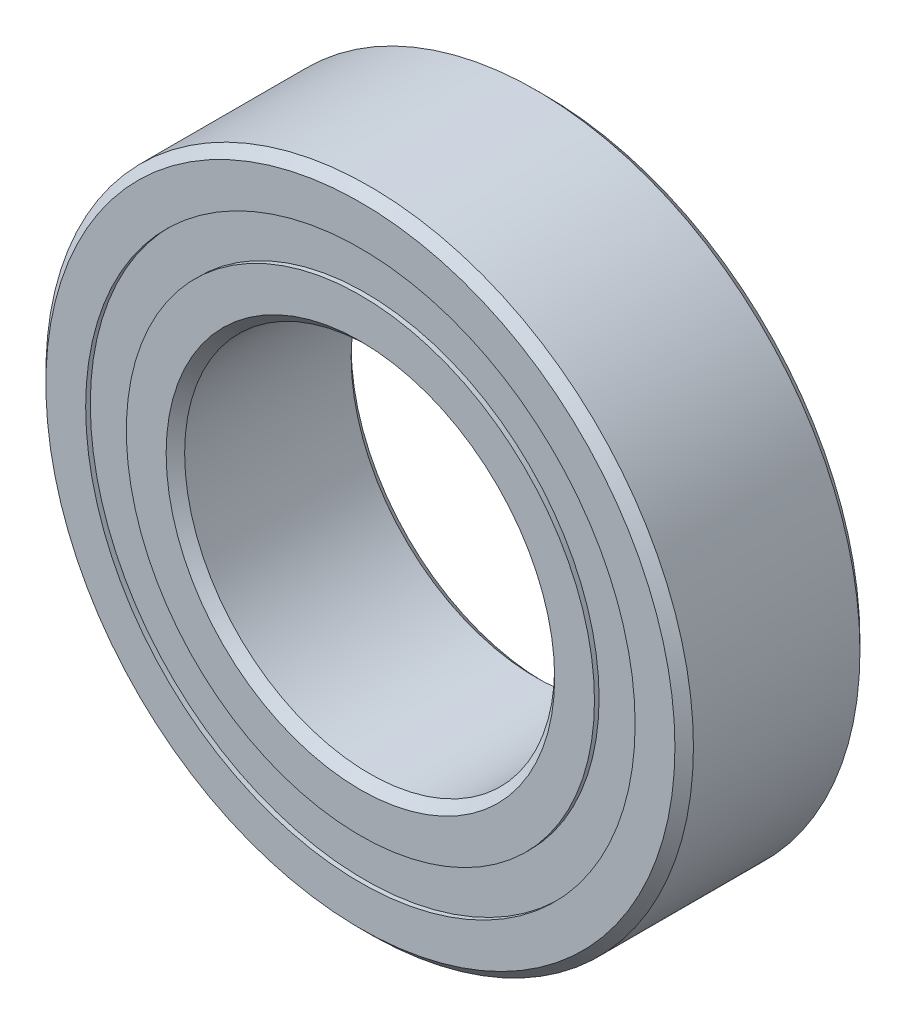
ISO-10303-21;
HEADER;
FILE_DESCRIPTION(('STEP AP214'),'2;1');
FILE_NAME('part.step','',(''),(''),'','','');
FILE_SCHEMA(('AUTOMOTIVE_DESIGN { 1 0 10303 214 1 1 1 1 }'));
ENDSEC;
DATA;
#1=APPLICATION_CONTEXT('core data for automotive mechanical design processes');
#2=APPLICATION_PROTOCOL_DEFINITION('international standard','automotive_design',2000,#1);
#3=PRODUCT_CONTEXT('',#1,'mechanical');
#4=PRODUCT('Part','Part','',(#3));
#5=PRODUCT_RELATED_PRODUCT_CATEGORY('part','',(#4));
#6=PRODUCT_DEFINITION_FORMATION('','',#4);
#7=PRODUCT_DEFINITION_CONTEXT('part definition',#1,'design');
#8=PRODUCT_DEFINITION('design','',#6,#7);
#9=PRODUCT_DEFINITION_SHAPE('','',#8);
#10=(LENGTH_UNIT() NAMED_UNIT(*) SI_UNIT(.MILLI.,.METRE.));
#11=(NAMED_UNIT(*) PLANE_ANGLE_UNIT() SI_UNIT($,.RADIAN.));
#12=(NAMED_UNIT(*) SI_UNIT($,.STERADIAN.) SOLID_ANGLE_UNIT());
#13=UNCERTAINTY_MEASURE_WITH_UNIT(LENGTH_MEASURE(1.E-05),#10,'distance_accuracy_value','');
#14=(GEOMETRIC_REPRESENTATION_CONTEXT(3) GLOBAL_UNCERTAINTY_ASSIGNED_CONTEXT((#13)) GLOBAL_UNIT_ASSIGNED_CONTEXT((#10,
#11,#12)) REPRESENTATION_CONTEXT('',''));
#15=CARTESIAN_POINT('',(0.,0.,0.));
#16=DIRECTION('',(0.,0.,1.));
#17=DIRECTION('',(1.,0.,0.));
#18=AXIS2_PLACEMENT_3D('',#15,#16,#17);
#19=CARTESIAN_POINT('',(0.,5.93956043956044,-1.9));
#20=DIRECTION('',(0.,0.,1.));
#21=DIRECTION('',(1.,0.,0.));
#22=AXIS2_PLACEMENT_3D('',#19,#20,#21);
#23=PLANE('',#22);
#24=CARTESIAN_POINT('',(0.,0.,-1.9));
#25=DIRECTION('',(0.,0.,1.));
#26=DIRECTION('',(1.,0.,0.));
#27=AXIS2_PLACEMENT_3D('',#24,#25,#26);
#28=CIRCLE('',#27,5.93956043956044);
#29=CARTESIAN_POINT('',(5.93956043956044,0.,-1.9));
#30=VERTEX_POINT('',#29);
#31=EDGE_CURVE('E55',#30,#30,#28,.T.);
#32=ORIENTED_EDGE('',*,*,#31,.F.);
#33=EDGE_LOOP('',(#32));
#34=FACE_BOUND('',#33,.T.);
#35=CARTESIAN_POINT('',(0.,0.,-1.9));
#36=DIRECTION('',(0.,0.,1.));
#37=DIRECTION('',(1.,0.,0.));
#38=AXIS2_PLACEMENT_3D('',#35,#36,#37);
#39=CIRCLE('',#38,5.06043956043956);
#40=CARTESIAN_POINT('',(5.06043956043956,0.,-1.9));
#41=VERTEX_POINT('',#40);
#42=EDGE_CURVE('E11',#41,#41,#39,.T.);
#43=ORIENTED_EDGE('',*,*,#42,.T.);
#44=EDGE_LOOP('',(#43));
#45=FACE_BOUND('',#44,.T.);
#46=ADVANCED_FACE('F41',(#34,#45),#23,.F.);
#47=CARTESIAN_POINT('',(0.,0.,2.));
#48=DIRECTION('',(0.,0.,1.));
#49=DIRECTION('',(1.,0.,0.));
#50=AXIS2_PLACEMENT_3D('',#47,#48,#49);
#51=CYLINDRICAL_SURFACE('',#50,5.06043956043956);
#52=ORIENTED_EDGE('',*,*,#42,.F.);
#53=EDGE_LOOP('',(#52));
#54=FACE_BOUND('',#53,.T.);
#55=CARTESIAN_POINT('',(0.,0.,-0.991633418565898));
#56=DIRECTION('',(0.,0.,1.));
#57=DIRECTION('',(1.,0.,0.));
#58=AXIS2_PLACEMENT_3D('',#55,#56,#57);
#59=CIRCLE('',#58,5.06043956043956);
#60=CARTESIAN_POINT('',(5.06043956043956,0.,-0.991633418565898));
#61=VERTEX_POINT('',#60);
#62=EDGE_CURVE('E47',#61,#61,#59,.T.);
#63=ORIENTED_EDGE('',*,*,#62,.T.);
#64=EDGE_LOOP('',(#63));
#65=FACE_BOUND('',#64,.T.);
#66=ADVANCED_FACE('F64',(#54,#65),#51,.F.);
#67=CARTESIAN_POINT('',(0.,5.93956043956044,-0.991633418565898));
#68=DIRECTION('',(0.,0.,-1.));
#69=DIRECTION('',(-1.,0.,0.));
#70=AXIS2_PLACEMENT_3D('',#67,#68,#69);
#71=PLANE('',#70);
#72=ORIENTED_EDGE('',*,*,#62,.F.);
#73=EDGE_LOOP('',(#72));
#74=FACE_BOUND('',#73,.T.);
#75=CARTESIAN_POINT('',(0.,0.,-0.991633418565898));
#76=DIRECTION('',(0.,0.,1.));
#77=DIRECTION('',(1.,0.,0.));
#78=AXIS2_PLACEMENT_3D('',#75,#76,#77);
#79=CIRCLE('',#78,5.93956043956044);
#80=CARTESIAN_POINT('',(5.93956043956044,0.,-0.991633418565898));
#81=VERTEX_POINT('',#80);
#82=EDGE_CURVE('E51',#81,#81,#79,.T.);
#83=ORIENTED_EDGE('',*,*,#82,.T.);
#84=EDGE_LOOP('',(#83));
#85=FACE_BOUND('',#84,.T.);
#86=ADVANCED_FACE('F68',(#74,#85),#71,.F.);
#87=CARTESIAN_POINT('',(0.,0.,2.));
#88=DIRECTION('',(0.,0.,1.));
#89=DIRECTION('',(1.,0.,0.));
#90=AXIS2_PLACEMENT_3D('',#87,#88,#89);
#91=CYLINDRICAL_SURFACE('',#90,5.93956043956044);
#92=ORIENTED_EDGE('',*,*,#82,.F.);
#93=EDGE_LOOP('',(#92));
#94=FACE_BOUND('',#93,.T.);
#95=ORIENTED_EDGE('',*,*,#31,.T.);
#96=EDGE_LOOP('',(#95));
#97=FACE_BOUND('',#96,.T.);
#98=ADVANCED_FACE('F61',(#94,#97),#91,.T.);
#99=CLOSED_SHELL('',(#46,#66,#86,#98));
#100=MANIFOLD_SOLID_BREP('B2',#99);
#101=CARTESIAN_POINT('',(0.,5.93956043956044,1.9));
#102=DIRECTION('',(0.,0.,-1.));
#103=DIRECTION('',(-1.,0.,0.));
#104=AXIS2_PLACEMENT_3D('',#101,#102,#103);
#105=PLANE('',#104);
#106=CARTESIAN_POINT('',(0.,0.,1.9));
#107=DIRECTION('',(0.,0.,1.));
#108=DIRECTION('',(1.,0.,0.));
#109=AXIS2_PLACEMENT_3D('',#106,#107,#108);
#110=CIRCLE('',#109,5.06043956043956);
#111=CARTESIAN_POINT('',(5.06043956043956,0.,1.9));
#112=VERTEX_POINT('',#111);
#113=EDGE_CURVE('E40',#112,#112,#110,.T.);
#114=ORIENTED_EDGE('',*,*,#113,.F.);
#115=EDGE_LOOP('',(#114));
#116=FACE_BOUND('',#115,.T.);
#117=CARTESIAN_POINT('',(0.,0.,1.9));
#118=DIRECTION('',(0.,0.,1.));
#119=DIRECTION('',(1.,0.,0.));
#120=AXIS2_PLACEMENT_3D('',#117,#118,#119);
#121=CIRCLE('',#120,5.93956043956044);
#122=CARTESIAN_POINT('',(5.93956043956044,0.,1.9));
#123=VERTEX_POINT('',#122);
#124=EDGE_CURVE('E122',#123,#123,#121,.T.);
#125=ORIENTED_EDGE('',*,*,#124,.T.);
#126=EDGE_LOOP('',(#125));
#127=FACE_BOUND('',#126,.T.);
#128=ADVANCED_FACE('F108',(#116,#127),#105,.F.);
#129=CARTESIAN_POINT('',(0.,0.,2.));
#130=DIRECTION('',(0.,0.,1.));
#131=DIRECTION('',(1.,0.,0.));
#132=AXIS2_PLACEMENT_3D('',#129,#130,#131);
#133=CYLINDRICAL_SURFACE('',#132,5.06043956043956);
#134=CARTESIAN_POINT('',(0.,0.,0.991633418565898));
#135=DIRECTION('',(0.,0.,1.));
#136=DIRECTION('',(1.,0.,0.));
#137=AXIS2_PLACEMENT_3D('',#134,#135,#136);
#138=CIRCLE('',#137,5.06043956043956);
#139=CARTESIAN_POINT('',(5.06043956043956,0.,0.991633418565898));
#140=VERTEX_POINT('',#139);
#141=EDGE_CURVE('E114',#140,#140,#138,.T.);
#142=ORIENTED_EDGE('',*,*,#141,.F.);
#143=EDGE_LOOP('',(#142));
#144=FACE_BOUND('',#143,.T.);
#145=ORIENTED_EDGE('',*,*,#113,.T.);
#146=EDGE_LOOP('',(#145));
#147=FACE_BOUND('',#146,.T.);
#148=ADVANCED_FACE('F137',(#144,#147),#133,.F.);
#149=CARTESIAN_POINT('',(0.,5.93956043956044,0.991633418565898));
#150=DIRECTION('',(0.,0.,1.));
#151=DIRECTION('',(1.,0.,0.));
#152=AXIS2_PLACEMENT_3D('',#149,#150,#151);
#153=PLANE('',#152);
#154=CARTESIAN_POINT('',(0.,0.,0.991633418565898));
#155=DIRECTION('',(0.,0.,1.));
#156=DIRECTION('',(1.,0.,0.));
#157=AXIS2_PLACEMENT_3D('',#154,#155,#156);
#158=CIRCLE('',#157,5.93956043956044);
#159=CARTESIAN_POINT('',(5.93956043956044,0.,0.991633418565898));
#160=VERTEX_POINT('',#159);
#161=EDGE_CURVE('E118',#160,#160,#158,.T.);
#162=ORIENTED_EDGE('',*,*,#161,.F.);
#163=EDGE_LOOP('',(#162));
#164=FACE_BOUND('',#163,.T.);
#165=ORIENTED_EDGE('',*,*,#141,.T.);
#166=EDGE_LOOP('',(#165));
#167=FACE_BOUND('',#166,.T.);
#168=ADVANCED_FACE('F132',(#164,#167),#153,.F.);
#169=CARTESIAN_POINT('',(0.,0.,2.));
#170=DIRECTION('',(0.,0.,1.));
#171=DIRECTION('',(1.,0.,0.));
#172=AXIS2_PLACEMENT_3D('',#169,#170,#171);
#173=CYLINDRICAL_SURFACE('',#172,5.93956043956044);
#174=ORIENTED_EDGE('',*,*,#124,.F.);
#175=EDGE_LOOP('',(#174));
#176=FACE_BOUND('',#175,.T.);
#177=ORIENTED_EDGE('',*,*,#161,.T.);
#178=EDGE_LOOP('',(#177));
#179=FACE_BOUND('',#178,.T.);
#180=ADVANCED_FACE('F129',(#176,#179),#173,.T.);
#181=CLOSED_SHELL('',(#128,#148,#168,#180));
#182=MANIFOLD_SOLID_BREP('B6',#181);
#183=CARTESIAN_POINT('',(-2.74999999999994,4.76313972081445,0.));
#184=DIRECTION('',(0.,0.,1.));
#185=DIRECTION('',(-0.499999999999989,0.866025403784445,0.));
#186=AXIS2_PLACEMENT_3D('',#183,#184,#185);
#187=SPHERICAL_SURFACE('',#186,0.991633418565898);
#188=CARTESIAN_POINT('',(-2.74999999999994,4.76313972081445,0.991633418565898));
#189=VERTEX_POINT('',#188);
#190=VERTEX_LOOP('',#189);
#191=FACE_BOUND('',#190,.T.);
#192=ADVANCED_FACE('F175',(#191),#187,.T.);
#193=CLOSED_SHELL('',(#192));
#194=MANIFOLD_SOLID_BREP('B35',#193);
#195=CARTESIAN_POINT('',(-4.76313972081438,2.75000000000006,0.));
#196=DIRECTION('',(0.,0.,1.));
#197=DIRECTION('',(-0.866025403784433,0.50000000000001,0.));
#198=AXIS2_PLACEMENT_3D('',#195,#196,#197);
#199=SPHERICAL_SURFACE('',#198,0.991633418565898);
#200=CARTESIAN_POINT('',(-4.76313972081438,2.75000000000006,0.991633418565898));
#201=VERTEX_POINT('',#200);
#202=VERTEX_LOOP('',#201);
#203=FACE_BOUND('',#202,.T.);
#204=ADVANCED_FACE('F195',(#203),#199,.T.);
#205=CLOSED_SHELL('',(#204));
#206=MANIFOLD_SOLID_BREP('B104',#205);
#207=CARTESIAN_POINT('',(-5.5,0.,0.));
#208=DIRECTION('',(0.,0.,1.));
#209=DIRECTION('',(-1.,0.,0.));
#210=AXIS2_PLACEMENT_3D('',#207,#208,#209);
#211=SPHERICAL_SURFACE('',#210,0.991633418565898);
#212=CARTESIAN_POINT('',(-5.5,0.,0.991633418565898));
#213=VERTEX_POINT('',#212);
#214=VERTEX_LOOP('',#213);
#215=FACE_BOUND('',#214,.T.);
#216=ADVANCED_FACE('F215',(#215),#211,.T.);
#217=CLOSED_SHELL('',(#216));
#218=MANIFOLD_SOLID_BREP('B171',#217);
#219=CARTESIAN_POINT('',(-4.76313972081444,-2.74999999999996,0.));
#220=DIRECTION('',(0.,0.,1.));
#221=DIRECTION('',(-0.866025403784443,-0.499999999999992,0.));
#222=AXIS2_PLACEMENT_3D('',#219,#220,#221);
#223=SPHERICAL_SURFACE('',#222,0.991633418565898);
#224=CARTESIAN_POINT('',(-4.76313972081444,-2.74999999999996,0.991633418565898));
#225=VERTEX_POINT('',#224);
#226=VERTEX_LOOP('',#225);
#227=FACE_BOUND('',#226,.T.);
#228=ADVANCED_FACE('F235',(#227),#223,.T.);
#229=CLOSED_SHELL('',(#228));
#230=MANIFOLD_SOLID_BREP('B191',#229);
#231=CARTESIAN_POINT('',(-2.75000000000004,-4.76313972081439,0.));
#232=DIRECTION('',(0.,0.,1.));
#233=DIRECTION('',(-0.500000000000007,-0.866025403784435,0.));
#234=AXIS2_PLACEMENT_3D('',#231,#232,#233);
#235=SPHERICAL_SURFACE('',#234,0.991633418565898);
#236=CARTESIAN_POINT('',(-2.75000000000004,-4.76313972081439,0.991633418565898));
#237=VERTEX_POINT('',#236);
#238=VERTEX_LOOP('',#237);
#239=FACE_BOUND('',#238,.T.);
#240=ADVANCED_FACE('F255',(#239),#235,.T.);
#241=CLOSED_SHELL('',(#240));
#242=MANIFOLD_SOLID_BREP('B211',#241);
#243=CARTESIAN_POINT('',(0.,-5.5,0.));
#244=DIRECTION('',(0.,0.,1.));
#245=DIRECTION('',(0.,-1.,0.));
#246=AXIS2_PLACEMENT_3D('',#243,#244,#245);
#247=SPHERICAL_SURFACE('',#246,0.991633418565898);
#248=CARTESIAN_POINT('',(0.,-5.5,0.991633418565898));
#249=VERTEX_POINT('',#248);
#250=VERTEX_LOOP('',#249);
#251=FACE_BOUND('',#250,.T.);
#252=ADVANCED_FACE('F275',(#251),#247,.T.);
#253=CLOSED_SHELL('',(#252));
#254=MANIFOLD_SOLID_BREP('B231',#253);
#255=CARTESIAN_POINT('',(2.74999999999997,-4.76313972081443,0.));
#256=DIRECTION('',(0.,0.,1.));
#257=DIRECTION('',(0.499999999999995,-0.866025403784442,0.));
#258=AXIS2_PLACEMENT_3D('',#255,#256,#257);
#259=SPHERICAL_SURFACE('',#258,0.991633418565898);
#260=CARTESIAN_POINT('',(2.74999999999997,-4.76313972081443,0.991633418565898));
#261=VERTEX_POINT('',#260);
#262=VERTEX_LOOP('',#261);
#263=FACE_BOUND('',#262,.T.);
#264=ADVANCED_FACE('F295',(#263),#259,.T.);
#265=CLOSED_SHELL('',(#264));
#266=MANIFOLD_SOLID_BREP('B251',#265);
#267=CARTESIAN_POINT('',(4.7631397208144,-2.75000000000002,0.));
#268=DIRECTION('',(0.,0.,1.));
#269=DIRECTION('',(0.866025403784436,-0.500000000000004,0.));
#270=AXIS2_PLACEMENT_3D('',#267,#268,#269);
#271=SPHERICAL_SURFACE('',#270,0.991633418565898);
#272=CARTESIAN_POINT('',(4.7631397208144,-2.75000000000002,0.991633418565898));
#273=VERTEX_POINT('',#272);
#274=VERTEX_LOOP('',#273);
#275=FACE_BOUND('',#274,.T.);
#276=ADVANCED_FACE('F315',(#275),#271,.T.);
#277=CLOSED_SHELL('',(#276));
#278=MANIFOLD_SOLID_BREP('B271',#277);
#279=CARTESIAN_POINT('',(5.5,0.,0.));
#280=DIRECTION('',(0.,0.,1.));
#281=DIRECTION('',(1.,0.,0.));
#282=AXIS2_PLACEMENT_3D('',#279,#280,#281);
#283=SPHERICAL_SURFACE('',#282,0.991633418565898);
#284=CARTESIAN_POINT('',(5.5,0.,0.991633418565898));
#285=VERTEX_POINT('',#284);
#286=VERTEX_LOOP('',#285);
#287=FACE_BOUND('',#286,.T.);
#288=ADVANCED_FACE('F335',(#287),#283,.T.);
#289=CLOSED_SHELL('',(#288));
#290=MANIFOLD_SOLID_BREP('B291',#289);
#291=CARTESIAN_POINT('',(4.76313972081442,2.74999999999999,0.));
#292=DIRECTION('',(0.,0.,1.));
#293=DIRECTION('',(0.86602540378444,0.499999999999998,0.));
#294=AXIS2_PLACEMENT_3D('',#291,#292,#293);
#295=SPHERICAL_SURFACE('',#294,0.991633418565898);
#296=CARTESIAN_POINT('',(4.76313972081442,2.74999999999999,0.991633418565898));
#297=VERTEX_POINT('',#296);
#298=VERTEX_LOOP('',#297);
#299=FACE_BOUND('',#298,.T.);
#300=ADVANCED_FACE('F355',(#299),#295,.T.);
#301=CLOSED_SHELL('',(#300));
#302=MANIFOLD_SOLID_BREP('B311',#301);
#303=CARTESIAN_POINT('',(2.75000000000001,4.76313972081441,0.));
#304=DIRECTION('',(0.,0.,1.));
#305=DIRECTION('',(0.500000000000001,0.866025403784438,0.));
#306=AXIS2_PLACEMENT_3D('',#303,#304,#305);
#307=SPHERICAL_SURFACE('',#306,0.991633418565898);
#308=CARTESIAN_POINT('',(2.75000000000001,4.76313972081441,0.991633418565898));
#309=VERTEX_POINT('',#308);
#310=VERTEX_LOOP('',#309);
#311=FACE_BOUND('',#310,.T.);
#312=ADVANCED_FACE('F375',(#311),#307,.T.);
#313=CLOSED_SHELL('',(#312));
#314=MANIFOLD_SOLID_BREP('B331',#313);
#315=CARTESIAN_POINT('',(0.,5.5,0.));
#316=DIRECTION('',(0.,0.,1.));
#317=DIRECTION('',(0.,1.,0.));
#318=AXIS2_PLACEMENT_3D('',#315,#316,#317);
#319=SPHERICAL_SURFACE('',#318,0.991633418565898);
#320=CARTESIAN_POINT('',(0.,5.5,0.991633418565898));
#321=VERTEX_POINT('',#320);
#322=VERTEX_LOOP('',#321);
#323=FACE_BOUND('',#322,.T.);
#324=ADVANCED_FACE('F397',(#323),#319,.T.);
#325=CLOSED_SHELL('',(#324));
#326=MANIFOLD_SOLID_BREP('B351',#325);
#327=CARTESIAN_POINT('',(0.,5.06043956043956,2.));
#328=DIRECTION('',(0.,0.,-1.));
#329=DIRECTION('',(-1.,0.,0.));
#330=AXIS2_PLACEMENT_3D('',#327,#328,#329);
#331=PLANE('',#330);
#332=CARTESIAN_POINT('',(0.,0.,2.));
#333=DIRECTION('',(0.,0.,1.));
#334=DIRECTION('',(1.,0.,0.));
#335=AXIS2_PLACEMENT_3D('',#332,#333,#334);
#336=CIRCLE('',#335,4.2);
#337=CARTESIAN_POINT('',(4.2,0.,2.));
#338=VERTEX_POINT('',#337);
#339=EDGE_CURVE('E444',#338,#338,#336,.T.);
#340=ORIENTED_EDGE('',*,*,#339,.F.);
#341=EDGE_LOOP('',(#340));
#342=FACE_BOUND('',#341,.T.);
#343=CARTESIAN_POINT('',(0.,0.,2.));
#344=DIRECTION('',(0.,0.,1.));
#345=DIRECTION('',(1.,0.,0.));
#346=AXIS2_PLACEMENT_3D('',#343,#344,#345);
#347=CIRCLE('',#346,5.06043956043956);
#348=CARTESIAN_POINT('',(5.06043956043956,0.,2.));
#349=VERTEX_POINT('',#348);
#350=EDGE_CURVE('E396',#349,#349,#347,.T.);
#351=ORIENTED_EDGE('',*,*,#350,.T.);
#352=EDGE_LOOP('',(#351));
#353=FACE_BOUND('',#352,.T.);
#354=ADVANCED_FACE('F416',(#342,#353),#331,.F.);
#355=CARTESIAN_POINT('',(0.,0.,2.));
#356=DIRECTION('',(0.,0.,1.));
#357=DIRECTION('',(1.,0.,0.));
#358=AXIS2_PLACEMENT_3D('',#355,#356,#357);
#359=CYLINDRICAL_SURFACE('',#358,5.06043956043956);
#360=ORIENTED_EDGE('',*,*,#350,.F.);
#361=EDGE_LOOP('',(#360));
#362=FACE_BOUND('',#361,.T.);
#363=CARTESIAN_POINT('',(0.,0.,0.888888888888889));
#364=DIRECTION('',(0.,0.,1.));
#365=DIRECTION('',(1.,0.,0.));
#366=AXIS2_PLACEMENT_3D('',#363,#364,#365);
#367=CIRCLE('',#366,5.06043956043956);
#368=CARTESIAN_POINT('',(5.06043956043956,0.,0.888888888888889));
#369=VERTEX_POINT('',#368);
#370=EDGE_CURVE('E422',#369,#369,#367,.T.);
#371=ORIENTED_EDGE('',*,*,#370,.T.);
#372=EDGE_LOOP('',(#371));
#373=FACE_BOUND('',#372,.T.);
#374=ADVANCED_FACE('F451',(#362,#373),#359,.T.);
#375=CARTESIAN_POINT('',(0.,0.,0.));
#376=DIRECTION('',(0.,0.,1.));
#377=DIRECTION('',(1.,0.,0.));
#378=AXIS2_PLACEMENT_3D('',#375,#376,#377);
#379=TOROIDAL_SURFACE('',#378,5.5,0.991633418565897);
#380=ORIENTED_EDGE('',*,*,#370,.F.);
#381=EDGE_LOOP('',(#380));
#382=FACE_BOUND('',#381,.T.);
#383=CARTESIAN_POINT('',(0.,0.,-0.88888888888889));
#384=DIRECTION('',(0.,0.,1.));
#385=DIRECTION('',(1.,0.,0.));
#386=AXIS2_PLACEMENT_3D('',#383,#384,#385);
#387=CIRCLE('',#386,5.06043956043956);
#388=CARTESIAN_POINT('',(5.06043956043956,0.,-0.88888888888889));
#389=VERTEX_POINT('',#388);
#390=EDGE_CURVE('E426',#389,#389,#387,.T.);
#391=ORIENTED_EDGE('',*,*,#390,.T.);
#392=EDGE_LOOP('',(#391));
#393=FACE_BOUND('',#392,.T.);
#394=ADVANCED_FACE('F455',(#382,#393),#379,.F.);
#395=CARTESIAN_POINT('',(0.,0.,2.));
#396=DIRECTION('',(0.,0.,1.));
#397=DIRECTION('',(1.,0.,0.));
#398=AXIS2_PLACEMENT_3D('',#395,#396,#397);
#399=CYLINDRICAL_SURFACE('',#398,5.06043956043956);
#400=ORIENTED_EDGE('',*,*,#390,.F.);
#401=EDGE_LOOP('',(#400));
#402=FACE_BOUND('',#401,.T.);
#403=CARTESIAN_POINT('',(0.,0.,-2.));
#404=DIRECTION('',(0.,0.,1.));
#405=DIRECTION('',(1.,0.,0.));
#406=AXIS2_PLACEMENT_3D('',#403,#404,#405);
#407=CIRCLE('',#406,5.06043956043956);
#408=CARTESIAN_POINT('',(5.06043956043956,0.,-2.));
#409=VERTEX_POINT('',#408);
#410=EDGE_CURVE('E430',#409,#409,#407,.T.);
#411=ORIENTED_EDGE('',*,*,#410,.T.);
#412=EDGE_LOOP('',(#411));
#413=FACE_BOUND('',#412,.T.);
#414=ADVANCED_FACE('F460',(#402,#413),#399,.T.);
#415=CARTESIAN_POINT('',(0.,4.2,-2.));
#416=DIRECTION('',(0.,0.,1.));
#417=DIRECTION('',(1.,0.,0.));
#418=AXIS2_PLACEMENT_3D('',#415,#416,#417);
#419=PLANE('',#418);
#420=ORIENTED_EDGE('',*,*,#410,.F.);
#421=EDGE_LOOP('',(#420));
#422=FACE_BOUND('',#421,.T.);
#423=CARTESIAN_POINT('',(0.,0.,-2.));
#424=DIRECTION('',(0.,0.,1.));
#425=DIRECTION('',(1.,0.,0.));
#426=AXIS2_PLACEMENT_3D('',#423,#424,#425);
#427=CIRCLE('',#426,4.2);
#428=CARTESIAN_POINT('',(4.2,0.,-2.));
#429=VERTEX_POINT('',#428);
#430=EDGE_CURVE('E435',#429,#429,#427,.T.);
#431=ORIENTED_EDGE('',*,*,#430,.T.);
#432=EDGE_LOOP('',(#431));
#433=FACE_BOUND('',#432,.T.);
#434=ADVANCED_FACE('F466',(#422,#433),#419,.F.);
#435=CARTESIAN_POINT('',(0.,0.,-1.8));
#436=DIRECTION('',(0.,0.,-1.));
#437=DIRECTION('',(-1.,0.,0.));
#438=AXIS2_PLACEMENT_3D('',#435,#436,#437);
#439=CONICAL_SURFACE('',#438,4.,0.785398163397446);
#440=ORIENTED_EDGE('',*,*,#430,.F.);
#441=EDGE_LOOP('',(#440));
#442=FACE_BOUND('',#441,.T.);
#443=CARTESIAN_POINT('',(0.,0.,-1.8));
#444=DIRECTION('',(0.,0.,1.));
#445=DIRECTION('',(1.,0.,0.));
#446=AXIS2_PLACEMENT_3D('',#443,#444,#445);
#447=CIRCLE('',#446,4.);
#448=CARTESIAN_POINT('',(4.,0.,-1.8));
#449=VERTEX_POINT('',#448);
#450=EDGE_CURVE('E438',#449,#449,#447,.T.);
#451=ORIENTED_EDGE('',*,*,#450,.T.);
#452=EDGE_LOOP('',(#451));
#453=FACE_BOUND('',#452,.T.);
#454=ADVANCED_FACE('F470',(#442,#453),#439,.F.);
#455=CARTESIAN_POINT('',(0.,0.,2.));
#456=DIRECTION('',(0.,0.,1.));
#457=DIRECTION('',(1.,0.,0.));
#458=AXIS2_PLACEMENT_3D('',#455,#456,#457);
#459=CYLINDRICAL_SURFACE('',#458,4.);
#460=ORIENTED_EDGE('',*,*,#450,.F.);
#461=EDGE_LOOP('',(#460));
#462=FACE_BOUND('',#461,.T.);
#463=CARTESIAN_POINT('',(0.,0.,1.8));
#464=DIRECTION('',(0.,0.,1.));
#465=DIRECTION('',(1.,0.,0.));
#466=AXIS2_PLACEMENT_3D('',#463,#464,#465);
#467=CIRCLE('',#466,4.);
#468=CARTESIAN_POINT('',(4.,0.,1.8));
#469=VERTEX_POINT('',#468);
#470=EDGE_CURVE('E441',#469,#469,#467,.T.);
#471=ORIENTED_EDGE('',*,*,#470,.T.);
#472=EDGE_LOOP('',(#471));
#473=FACE_BOUND('',#472,.T.);
#474=ADVANCED_FACE('F474',(#462,#473),#459,.F.);
#475=CARTESIAN_POINT('',(0.,0.,2.));
#476=DIRECTION('',(0.,0.,1.));
#477=DIRECTION('',(1.,0.,0.));
#478=AXIS2_PLACEMENT_3D('',#475,#476,#477);
#479=CONICAL_SURFACE('',#478,4.2,0.785398163397449);
#480=ORIENTED_EDGE('',*,*,#470,.F.);
#481=EDGE_LOOP('',(#480));
#482=FACE_BOUND('',#481,.T.);
#483=ORIENTED_EDGE('',*,*,#339,.T.);
#484=EDGE_LOOP('',(#483));
#485=FACE_BOUND('',#484,.T.);
#486=ADVANCED_FACE('F448',(#482,#485),#479,.F.);
#487=CLOSED_SHELL('',(#354,#374,#394,#414,#434,#454,#474,#486));
#488=MANIFOLD_SOLID_BREP('B371',#487);
#489=CARTESIAN_POINT('',(0.,0.,1.8));
#490=DIRECTION('',(0.,0.,-1.));
#491=DIRECTION('',(-1.,0.,0.));
#492=AXIS2_PLACEMENT_3D('',#489,#490,#491);
#493=CONICAL_SURFACE('',#492,7.,0.785398163397445);
#494=CARTESIAN_POINT('',(0.,0.,2.));
#495=DIRECTION('',(0.,0.,1.));
#496=DIRECTION('',(1.,0.,0.));
#497=AXIS2_PLACEMENT_3D('',#494,#495,#496);
#498=CIRCLE('',#497,6.8);
#499=CARTESIAN_POINT('',(6.8,0.,2.));
#500=VERTEX_POINT('',#499);
#501=EDGE_CURVE('E565',#500,#500,#498,.T.);
#502=ORIENTED_EDGE('',*,*,#501,.F.);
#503=EDGE_LOOP('',(#502));
#504=FACE_BOUND('',#503,.T.);
#505=CARTESIAN_POINT('',(0.,0.,1.8));
#506=DIRECTION('',(0.,0.,1.));
#507=DIRECTION('',(1.,0.,0.));
#508=AXIS2_PLACEMENT_3D('',#505,#506,#507);
#509=CIRCLE('',#508,7.);
#510=CARTESIAN_POINT('',(7.,0.,1.8));
#511=VERTEX_POINT('',#510);
#512=EDGE_CURVE('E415',#511,#511,#509,.T.);
#513=ORIENTED_EDGE('',*,*,#512,.T.);
#514=EDGE_LOOP('',(#513));
#515=FACE_BOUND('',#514,.T.);
#516=ADVANCED_FACE('F537',(#504,#515),#493,.T.);
#517=CARTESIAN_POINT('',(0.,0.,2.));
#518=DIRECTION('',(0.,0.,1.));
#519=DIRECTION('',(1.,0.,0.));
#520=AXIS2_PLACEMENT_3D('',#517,#518,#519);
#521=CYLINDRICAL_SURFACE('',#520,7.);
#522=ORIENTED_EDGE('',*,*,#512,.F.);
#523=EDGE_LOOP('',(#522));
#524=FACE_BOUND('',#523,.T.);
#525=CARTESIAN_POINT('',(0.,0.,-1.8));
#526=DIRECTION('',(0.,0.,1.));
#527=DIRECTION('',(1.,0.,0.));
#528=AXIS2_PLACEMENT_3D('',#525,#526,#527);
#529=CIRCLE('',#528,7.);
#530=CARTESIAN_POINT('',(7.,0.,-1.8));
#531=VERTEX_POINT('',#530);
#532=EDGE_CURVE('E543',#531,#531,#529,.T.);
#533=ORIENTED_EDGE('',*,*,#532,.T.);
#534=EDGE_LOOP('',(#533));
#535=FACE_BOUND('',#534,.T.);
#536=ADVANCED_FACE('F572',(#524,#535),#521,.T.);
#537=CARTESIAN_POINT('',(0.,0.,-2.));
#538=DIRECTION('',(0.,0.,1.));
#539=DIRECTION('',(1.,0.,0.));
#540=AXIS2_PLACEMENT_3D('',#537,#538,#539);
#541=CONICAL_SURFACE('',#540,6.8,0.785398163397446);
#542=ORIENTED_EDGE('',*,*,#532,.F.);
#543=EDGE_LOOP('',(#542));
#544=FACE_BOUND('',#543,.T.);
#545=CARTESIAN_POINT('',(0.,0.,-2.));
#546=DIRECTION('',(0.,0.,1.));
#547=DIRECTION('',(1.,0.,0.));
#548=AXIS2_PLACEMENT_3D('',#545,#546,#547);
#549=CIRCLE('',#548,6.8);
#550=CARTESIAN_POINT('',(6.8,0.,-2.));
#551=VERTEX_POINT('',#550);
#552=EDGE_CURVE('E547',#551,#551,#549,.T.);
#553=ORIENTED_EDGE('',*,*,#552,.T.);
#554=EDGE_LOOP('',(#553));
#555=FACE_BOUND('',#554,.T.);
#556=ADVANCED_FACE('F576',(#544,#555),#541,.T.);
#557=CARTESIAN_POINT('',(0.,6.8,-2.));
#558=DIRECTION('',(0.,0.,1.));
#559=DIRECTION('',(1.,0.,0.));
#560=AXIS2_PLACEMENT_3D('',#557,#558,#559);
#561=PLANE('',#560);
#562=ORIENTED_EDGE('',*,*,#552,.F.);
#563=EDGE_LOOP('',(#562));
#564=FACE_BOUND('',#563,.T.);
#565=CARTESIAN_POINT('',(0.,0.,-2.));
#566=DIRECTION('',(0.,0.,1.));
#567=DIRECTION('',(1.,0.,0.));
#568=AXIS2_PLACEMENT_3D('',#565,#566,#567);
#569=CIRCLE('',#568,5.93956043956044);
#570=CARTESIAN_POINT('',(5.93956043956044,0.,-2.));
#571=VERTEX_POINT('',#570);
#572=EDGE_CURVE('E551',#571,#571,#569,.T.);
#573=ORIENTED_EDGE('',*,*,#572,.T.);
#574=EDGE_LOOP('',(#573));
#575=FACE_BOUND('',#574,.T.);
#576=ADVANCED_FACE('F581',(#564,#575),#561,.F.);
#577=CARTESIAN_POINT('',(0.,0.,2.));
#578=DIRECTION('',(0.,0.,1.));
#579=DIRECTION('',(1.,0.,0.));
#580=AXIS2_PLACEMENT_3D('',#577,#578,#579);
#581=CYLINDRICAL_SURFACE('',#580,5.93956043956044);
#582=ORIENTED_EDGE('',*,*,#572,.F.);
#583=EDGE_LOOP('',(#582));
#584=FACE_BOUND('',#583,.T.);
#585=CARTESIAN_POINT('',(0.,0.,-0.888888888888889));
#586=DIRECTION('',(0.,0.,1.));
#587=DIRECTION('',(1.,0.,0.));
#588=AXIS2_PLACEMENT_3D('',#585,#586,#587);
#589=CIRCLE('',#588,5.93956043956044);
#590=CARTESIAN_POINT('',(5.93956043956044,0.,-0.888888888888889));
#591=VERTEX_POINT('',#590);
#592=EDGE_CURVE('E556',#591,#591,#589,.T.);
#593=ORIENTED_EDGE('',*,*,#592,.T.);
#594=EDGE_LOOP('',(#593));
#595=FACE_BOUND('',#594,.T.);
#596=ADVANCED_FACE('F587',(#584,#595),#581,.F.);
#597=CARTESIAN_POINT('',(0.,0.,0.));
#598=DIRECTION('',(0.,0.,1.));
#599=DIRECTION('',(1.,0.,0.));
#600=AXIS2_PLACEMENT_3D('',#597,#598,#599);
#601=TOROIDAL_SURFACE('',#600,5.5,0.991633418565898);
#602=ORIENTED_EDGE('',*,*,#592,.F.);
#603=EDGE_LOOP('',(#602));
#604=FACE_BOUND('',#603,.T.);
#605=CARTESIAN_POINT('',(0.,0.,0.888888888888889));
#606=DIRECTION('',(0.,0.,1.));
#607=DIRECTION('',(1.,0.,0.));
#608=AXIS2_PLACEMENT_3D('',#605,#606,#607);
#609=CIRCLE('',#608,5.93956043956044);
#610=CARTESIAN_POINT('',(5.93956043956044,0.,0.888888888888889));
#611=VERTEX_POINT('',#610);
#612=EDGE_CURVE('E559',#611,#611,#609,.T.);
#613=ORIENTED_EDGE('',*,*,#612,.T.);
#614=EDGE_LOOP('',(#613));
#615=FACE_BOUND('',#614,.T.);
#616=ADVANCED_FACE('F591',(#604,#615),#601,.F.);
#617=CARTESIAN_POINT('',(0.,0.,2.));
#618=DIRECTION('',(0.,0.,1.));
#619=DIRECTION('',(1.,0.,0.));
#620=AXIS2_PLACEMENT_3D('',#617,#618,#619);
#621=CYLINDRICAL_SURFACE('',#620,5.93956043956044);
#622=ORIENTED_EDGE('',*,*,#612,.F.);
#623=EDGE_LOOP('',(#622));
#624=FACE_BOUND('',#623,.T.);
#625=CARTESIAN_POINT('',(0.,0.,2.));
#626=DIRECTION('',(0.,0.,1.));
#627=DIRECTION('',(1.,0.,0.));
#628=AXIS2_PLACEMENT_3D('',#625,#626,#627);
#629=CIRCLE('',#628,5.93956043956044);
#630=CARTESIAN_POINT('',(5.93956043956044,0.,2.));
#631=VERTEX_POINT('',#630);
#632=EDGE_CURVE('E562',#631,#631,#629,.T.);
#633=ORIENTED_EDGE('',*,*,#632,.T.);
#634=EDGE_LOOP('',(#633));
#635=FACE_BOUND('',#634,.T.);
#636=ADVANCED_FACE('F595',(#624,#635),#621,.F.);
#637=CARTESIAN_POINT('',(0.,6.8,2.));
#638=DIRECTION('',(0.,0.,-1.));
#639=DIRECTION('',(-1.,0.,0.));
#640=AXIS2_PLACEMENT_3D('',#637,#638,#639);
#641=PLANE('',#640);
#642=ORIENTED_EDGE('',*,*,#632,.F.);
#643=EDGE_LOOP('',(#642));
#644=FACE_BOUND('',#643,.T.);
#645=ORIENTED_EDGE('',*,*,#501,.T.);
#646=EDGE_LOOP('',(#645));
#647=FACE_BOUND('',#646,.T.);
#648=ADVANCED_FACE('F569',(#644,#647),#641,.F.);
#649=CLOSED_SHELL('',(#516,#536,#556,#576,#596,#616,#636,#648));
#650=MANIFOLD_SOLID_BREP('B391',#649);
#651=ADVANCED_BREP_SHAPE_REPRESENTATION('',(#18,#100,#182,#194,#206,#218,#230,#242,#254,#266,
#278,#290,#302,#314,#326,#488,#650),#14);
#652=SHAPE_DEFINITION_REPRESENTATION(#9,#651);
ENDSEC;
END-ISO-10303-21;
